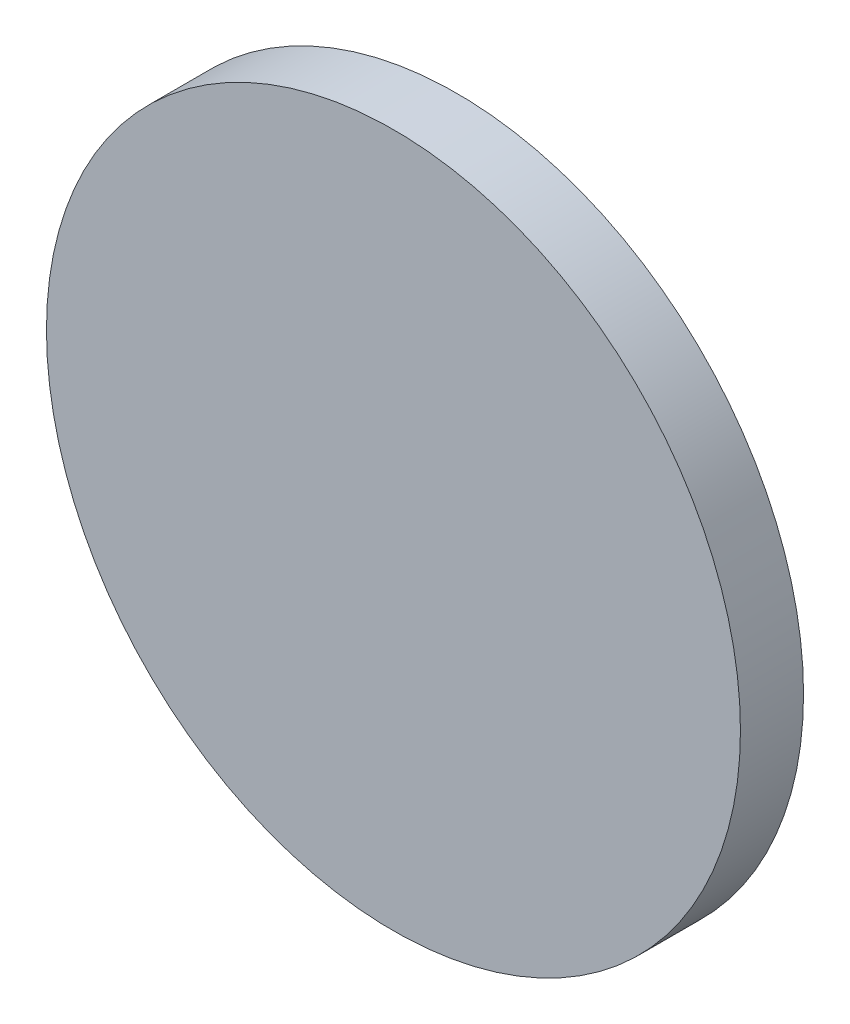
ISO-10303-21;
HEADER;
FILE_DESCRIPTION(('STEP AP214'),'2;1');
FILE_NAME('part.step','',(''),(''),'','','');
FILE_SCHEMA(('AUTOMOTIVE_DESIGN { 1 0 10303 214 1 1 1 1 }'));
ENDSEC;
DATA;
#1=APPLICATION_CONTEXT('core data for automotive mechanical design processes');
#2=APPLICATION_PROTOCOL_DEFINITION('international standard','automotive_design',2000,#1);
#3=PRODUCT_CONTEXT('',#1,'mechanical');
#4=PRODUCT('Part','Part','',(#3));
#5=PRODUCT_RELATED_PRODUCT_CATEGORY('part','',(#4));
#6=PRODUCT_DEFINITION_FORMATION('','',#4);
#7=PRODUCT_DEFINITION_CONTEXT('part definition',#1,'design');
#8=PRODUCT_DEFINITION('design','',#6,#7);
#9=PRODUCT_DEFINITION_SHAPE('','',#8);
#10=(LENGTH_UNIT() NAMED_UNIT(*) SI_UNIT(.MILLI.,.METRE.));
#11=(NAMED_UNIT(*) PLANE_ANGLE_UNIT() SI_UNIT($,.RADIAN.));
#12=(NAMED_UNIT(*) SI_UNIT($,.STERADIAN.) SOLID_ANGLE_UNIT());
#13=UNCERTAINTY_MEASURE_WITH_UNIT(LENGTH_MEASURE(1.E-05),#10,'distance_accuracy_value','');
#14=(GEOMETRIC_REPRESENTATION_CONTEXT(3) GLOBAL_UNCERTAINTY_ASSIGNED_CONTEXT((#13)) GLOBAL_UNIT_ASSIGNED_CONTEXT((#10,
#11,#12)) REPRESENTATION_CONTEXT('',''));
#15=CARTESIAN_POINT('',(0.,0.,0.));
#16=DIRECTION('',(0.,0.,1.));
#17=DIRECTION('',(1.,0.,0.));
#18=AXIS2_PLACEMENT_3D('',#15,#16,#17);
#19=CARTESIAN_POINT('',(0.,-17.75,2.));
#20=DIRECTION('',(0.,0.,-1.));
#21=DIRECTION('',(-1.,0.,0.));
#22=AXIS2_PLACEMENT_3D('',#19,#20,#21);
#23=CYLINDRICAL_SURFACE('',#22,11.);
#24=CARTESIAN_POINT('',(0.,-17.75,2.));
#25=DIRECTION('',(0.,0.,1.));
#26=DIRECTION('',(1.,0.,0.));
#27=AXIS2_PLACEMENT_3D('',#24,#25,#26);
#28=CIRCLE('',#27,11.);
#29=CARTESIAN_POINT('',(11.,-17.75,2.));
#30=VERTEX_POINT('',#29);
#31=EDGE_CURVE('E10',#30,#30,#28,.T.);
#32=ORIENTED_EDGE('',*,*,#31,.F.);
#33=EDGE_LOOP('',(#32));
#34=FACE_BOUND('',#33,.T.);
#35=CARTESIAN_POINT('',(0.,-17.75,0.));
#36=DIRECTION('',(0.,0.,1.));
#37=DIRECTION('',(1.,0.,0.));
#38=AXIS2_PLACEMENT_3D('',#35,#36,#37);
#39=CIRCLE('',#38,11.);
#40=CARTESIAN_POINT('',(11.,-17.75,0.));
#41=VERTEX_POINT('',#40);
#42=EDGE_CURVE('E31',#41,#41,#39,.T.);
#43=ORIENTED_EDGE('',*,*,#42,.T.);
#44=EDGE_LOOP('',(#43));
#45=FACE_BOUND('',#44,.T.);
#46=ADVANCED_FACE('F28',(#34,#45),#23,.T.);
#47=CARTESIAN_POINT('',(0.,-17.75,2.));
#48=DIRECTION('',(0.,0.,1.));
#49=DIRECTION('',(1.,0.,0.));
#50=AXIS2_PLACEMENT_3D('',#47,#48,#49);
#51=PLANE('',#50);
#52=ORIENTED_EDGE('',*,*,#31,.T.);
#53=EDGE_LOOP('',(#52));
#54=FACE_BOUND('',#53,.T.);
#55=ADVANCED_FACE('F43',(#54),#51,.T.);
#56=CARTESIAN_POINT('',(0.,-17.75,0.));
#57=DIRECTION('',(0.,0.,1.));
#58=DIRECTION('',(1.,0.,0.));
#59=AXIS2_PLACEMENT_3D('',#56,#57,#58);
#60=PLANE('',#59);
#61=ORIENTED_EDGE('',*,*,#42,.F.);
#62=EDGE_LOOP('',(#61));
#63=FACE_BOUND('',#62,.T.);
#64=ADVANCED_FACE('F41',(#63),#60,.F.);
#65=CLOSED_SHELL('',(#46,#55,#64));
#66=MANIFOLD_SOLID_BREP('B2',#65);
#67=ADVANCED_BREP_SHAPE_REPRESENTATION('',(#18,#66),#14);
#68=SHAPE_DEFINITION_REPRESENTATION(#9,#67);
ENDSEC;
END-ISO-10303-21;
